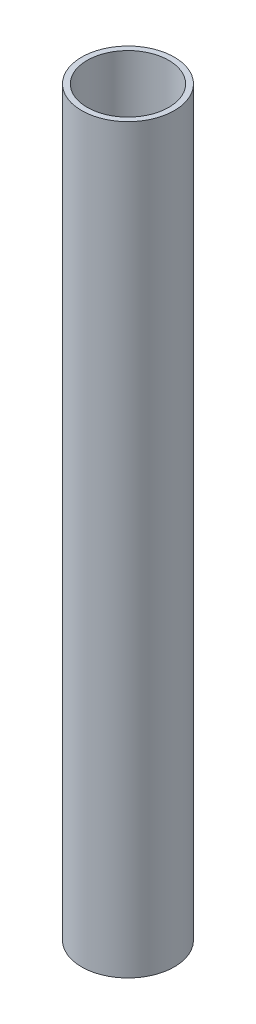
ISO-10303-21;
HEADER;
FILE_DESCRIPTION(('STEP AP214'),'2;1');
FILE_NAME('part.step','',(''),(''),'','','');
FILE_SCHEMA(('AUTOMOTIVE_DESIGN { 1 0 10303 214 1 1 1 1 }'));
ENDSEC;
DATA;
#1=APPLICATION_CONTEXT('core data for automotive mechanical design processes');
#2=APPLICATION_PROTOCOL_DEFINITION('international standard','automotive_design',2000,#1);
#3=PRODUCT_CONTEXT('',#1,'mechanical');
#4=PRODUCT('Part','Part','',(#3));
#5=PRODUCT_RELATED_PRODUCT_CATEGORY('part','',(#4));
#6=PRODUCT_DEFINITION_FORMATION('','',#4);
#7=PRODUCT_DEFINITION_CONTEXT('part definition',#1,'design');
#8=PRODUCT_DEFINITION('design','',#6,#7);
#9=PRODUCT_DEFINITION_SHAPE('','',#8);
#10=(LENGTH_UNIT() NAMED_UNIT(*) SI_UNIT(.MILLI.,.METRE.));
#11=(NAMED_UNIT(*) PLANE_ANGLE_UNIT() SI_UNIT($,.RADIAN.));
#12=(NAMED_UNIT(*) SI_UNIT($,.STERADIAN.) SOLID_ANGLE_UNIT());
#13=UNCERTAINTY_MEASURE_WITH_UNIT(LENGTH_MEASURE(1.E-05),#10,'distance_accuracy_value','');
#14=(GEOMETRIC_REPRESENTATION_CONTEXT(3) GLOBAL_UNCERTAINTY_ASSIGNED_CONTEXT((#13)) GLOBAL_UNIT_ASSIGNED_CONTEXT((#10,
#11,#12)) REPRESENTATION_CONTEXT('',''));
#15=CARTESIAN_POINT('',(0.,0.,0.));
#16=DIRECTION('',(0.,0.,1.));
#17=DIRECTION('',(1.,0.,0.));
#18=AXIS2_PLACEMENT_3D('',#15,#16,#17);
#19=CARTESIAN_POINT('',(0.,203.2,0.));
#20=DIRECTION('',(0.,1.,0.));
#21=DIRECTION('',(0.,0.,1.));
#22=AXIS2_PLACEMENT_3D('',#19,#20,#21);
#23=PLANE('',#22);
#24=CARTESIAN_POINT('',(0.,203.2,0.));
#25=DIRECTION('',(0.,1.,0.));
#26=DIRECTION('',(0.,0.,1.));
#27=AXIS2_PLACEMENT_3D('',#24,#25,#26);
#28=CIRCLE('',#27,12.7);
#29=CARTESIAN_POINT('',(0.,203.2,12.7));
#30=VERTEX_POINT('',#29);
#31=EDGE_CURVE('E10',#30,#30,#28,.T.);
#32=ORIENTED_EDGE('',*,*,#31,.T.);
#33=EDGE_LOOP('',(#32));
#34=FACE_BOUND('',#33,.T.);
#35=CARTESIAN_POINT('',(0.,203.2,0.));
#36=DIRECTION('',(0.,1.,0.));
#37=DIRECTION('',(0.,0.,1.));
#38=AXIS2_PLACEMENT_3D('',#35,#36,#37);
#39=CIRCLE('',#38,11.176);
#40=CARTESIAN_POINT('',(0.,203.2,11.176));
#41=VERTEX_POINT('',#40);
#42=EDGE_CURVE('E42',#41,#41,#39,.T.);
#43=ORIENTED_EDGE('',*,*,#42,.F.);
#44=EDGE_LOOP('',(#43));
#45=FACE_BOUND('',#44,.T.);
#46=ADVANCED_FACE('F31',(#34,#45),#23,.T.);
#47=CARTESIAN_POINT('',(0.,0.,0.));
#48=DIRECTION('',(0.,1.,0.));
#49=DIRECTION('',(0.,0.,1.));
#50=AXIS2_PLACEMENT_3D('',#47,#48,#49);
#51=PLANE('',#50);
#52=CARTESIAN_POINT('',(0.,0.,0.));
#53=DIRECTION('',(0.,1.,0.));
#54=DIRECTION('',(0.,0.,1.));
#55=AXIS2_PLACEMENT_3D('',#52,#53,#54);
#56=CIRCLE('',#55,12.7);
#57=CARTESIAN_POINT('',(0.,0.,12.7));
#58=VERTEX_POINT('',#57);
#59=EDGE_CURVE('E35',#58,#58,#56,.T.);
#60=ORIENTED_EDGE('',*,*,#59,.F.);
#61=EDGE_LOOP('',(#60));
#62=FACE_BOUND('',#61,.T.);
#63=CARTESIAN_POINT('',(0.,0.,0.));
#64=DIRECTION('',(0.,1.,0.));
#65=DIRECTION('',(0.,0.,1.));
#66=AXIS2_PLACEMENT_3D('',#63,#64,#65);
#67=CIRCLE('',#66,11.176);
#68=CARTESIAN_POINT('',(0.,0.,11.176));
#69=VERTEX_POINT('',#68);
#70=EDGE_CURVE('E44',#69,#69,#67,.T.);
#71=ORIENTED_EDGE('',*,*,#70,.T.);
#72=EDGE_LOOP('',(#71));
#73=FACE_BOUND('',#72,.T.);
#74=ADVANCED_FACE('F54',(#62,#73),#51,.F.);
#75=CARTESIAN_POINT('',(0.,203.2,0.));
#76=DIRECTION('',(0.,-1.,0.));
#77=DIRECTION('',(0.,0.,-1.));
#78=AXIS2_PLACEMENT_3D('',#75,#76,#77);
#79=CYLINDRICAL_SURFACE('',#78,12.7);
#80=ORIENTED_EDGE('',*,*,#31,.F.);
#81=EDGE_LOOP('',(#80));
#82=FACE_BOUND('',#81,.T.);
#83=ORIENTED_EDGE('',*,*,#59,.T.);
#84=EDGE_LOOP('',(#83));
#85=FACE_BOUND('',#84,.T.);
#86=ADVANCED_FACE('F33',(#82,#85),#79,.T.);
#87=CARTESIAN_POINT('',(0.,203.2,0.));
#88=DIRECTION('',(0.,-1.,0.));
#89=DIRECTION('',(0.,0.,-1.));
#90=AXIS2_PLACEMENT_3D('',#87,#88,#89);
#91=CYLINDRICAL_SURFACE('',#90,11.176);
#92=ORIENTED_EDGE('',*,*,#42,.T.);
#93=EDGE_LOOP('',(#92));
#94=FACE_BOUND('',#93,.T.);
#95=ORIENTED_EDGE('',*,*,#70,.F.);
#96=EDGE_LOOP('',(#95));
#97=FACE_BOUND('',#96,.T.);
#98=ADVANCED_FACE('F50',(#94,#97),#91,.F.);
#99=CLOSED_SHELL('',(#46,#74,#86,#98));
#100=MANIFOLD_SOLID_BREP('B2',#99);
#101=ADVANCED_BREP_SHAPE_REPRESENTATION('',(#18,#100),#14);
#102=SHAPE_DEFINITION_REPRESENTATION(#9,#101);
ENDSEC;
END-ISO-10303-21;
